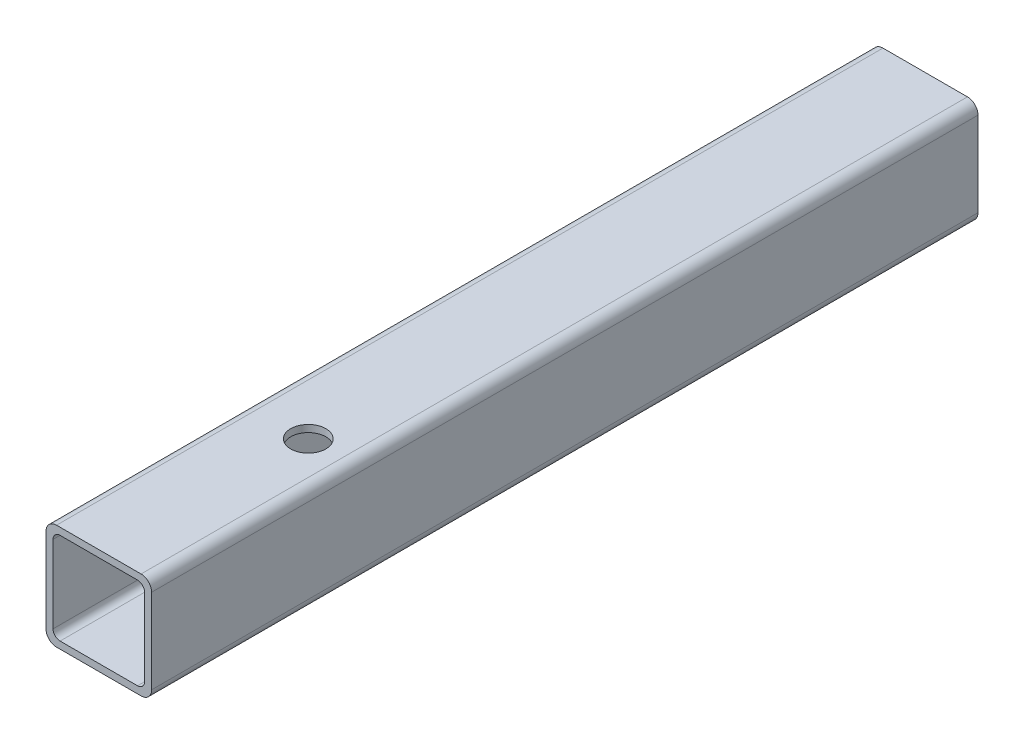
ISO-10303-21;
HEADER;
FILE_DESCRIPTION(('STEP AP214'),'2;1');
FILE_NAME('part.step','',(''),(''),'','','');
FILE_SCHEMA(('AUTOMOTIVE_DESIGN { 1 0 10303 214 1 1 1 1 }'));
ENDSEC;
DATA;
#1=APPLICATION_CONTEXT('core data for automotive mechanical design processes');
#2=APPLICATION_PROTOCOL_DEFINITION('international standard','automotive_design',2000,#1);
#3=PRODUCT_CONTEXT('',#1,'mechanical');
#4=PRODUCT('Part','Part','',(#3));
#5=PRODUCT_RELATED_PRODUCT_CATEGORY('part','',(#4));
#6=PRODUCT_DEFINITION_FORMATION('','',#4);
#7=PRODUCT_DEFINITION_CONTEXT('part definition',#1,'design');
#8=PRODUCT_DEFINITION('design','',#6,#7);
#9=PRODUCT_DEFINITION_SHAPE('','',#8);
#10=(LENGTH_UNIT() NAMED_UNIT(*) SI_UNIT(.MILLI.,.METRE.));
#11=(NAMED_UNIT(*) PLANE_ANGLE_UNIT() SI_UNIT($,.RADIAN.));
#12=(NAMED_UNIT(*) SI_UNIT($,.STERADIAN.) SOLID_ANGLE_UNIT());
#13=UNCERTAINTY_MEASURE_WITH_UNIT(LENGTH_MEASURE(1.E-05),#10,'distance_accuracy_value','');
#14=(GEOMETRIC_REPRESENTATION_CONTEXT(3) GLOBAL_UNCERTAINTY_ASSIGNED_CONTEXT((#13)) GLOBAL_UNIT_ASSIGNED_CONTEXT((#10,
#11,#12)) REPRESENTATION_CONTEXT('',''));
#15=CARTESIAN_POINT('',(0.,0.,0.));
#16=DIRECTION('',(0.,0.,1.));
#17=DIRECTION('',(1.,0.,0.));
#18=AXIS2_PLACEMENT_3D('',#15,#16,#17);
#19=CARTESIAN_POINT('',(-12.,-26.9999999999997,-277.159604319513));
#20=DIRECTION('',(0.,0.,1.));
#21=DIRECTION('',(1.,0.,0.));
#22=AXIS2_PLACEMENT_3D('',#19,#20,#21);
#23=CYLINDRICAL_SURFACE('',#22,3.);
#24=DIRECTION('',(0.,0.,1.));
#25=VECTOR('',#24,1.);
#26=CARTESIAN_POINT('',(-15.,-26.9999999999997,-277.159604319513));
#27=LINE('',#26,#25);
#28=CARTESIAN_POINT('',(-15.,-26.9999999999997,-234.733197448321));
#29=VERTEX_POINT('',#28);
#30=CARTESIAN_POINT('',(-15.,-26.9999999999997,0.));
#31=VERTEX_POINT('',#30);
#32=EDGE_CURVE('E191',#29,#31,#27,.T.);
#33=ORIENTED_EDGE('',*,*,#32,.F.);
#34=CARTESIAN_POINT('',(-12.,-26.9999999999997,-234.733197448321));
#35=DIRECTION('',(0.,0.,-1.));
#36=DIRECTION('',(0.,1.,0.));
#37=AXIS2_PLACEMENT_3D('',#34,#35,#36);
#38=CIRCLE('',#37,3.);
#39=CARTESIAN_POINT('',(-12.,-29.9999999999997,-234.733197448321));
#40=VERTEX_POINT('',#39);
#41=EDGE_CURVE('E184',#29,#40,#38,.F.);
#42=ORIENTED_EDGE('',*,*,#41,.T.);
#43=DIRECTION('',(0.,0.,1.));
#44=VECTOR('',#43,1.);
#45=CARTESIAN_POINT('',(-12.,-29.9999999999997,-277.159604319513));
#46=LINE('',#45,#44);
#47=CARTESIAN_POINT('',(-12.,-29.9999999999997,0.));
#48=VERTEX_POINT('',#47);
#49=EDGE_CURVE('E186',#40,#48,#46,.T.);
#50=ORIENTED_EDGE('',*,*,#49,.T.);
#51=CARTESIAN_POINT('',(-12.,-26.9999999999997,0.));
#52=DIRECTION('',(0.,0.,1.));
#53=DIRECTION('',(1.,0.,0.));
#54=AXIS2_PLACEMENT_3D('',#51,#52,#53);
#55=CIRCLE('',#54,3.);
#56=EDGE_CURVE('E250',#31,#48,#55,.T.);
#57=ORIENTED_EDGE('',*,*,#56,.F.);
#58=EDGE_LOOP('',(#33,#42,#50,#57));
#59=FACE_BOUND('',#58,.T.);
#60=ADVANCED_FACE('F35',(#59),#23,.T.);
#61=CARTESIAN_POINT('',(-15.,-2.99999999999971,-277.159604319513));
#62=DIRECTION('',(-1.,0.,0.));
#63=DIRECTION('',(0.,0.,1.));
#64=AXIS2_PLACEMENT_3D('',#61,#62,#63);
#65=PLANE('',#64);
#66=DIRECTION('',(0.,0.,1.));
#67=VECTOR('',#66,1.);
#68=CARTESIAN_POINT('',(-15.,-2.99999999999971,-277.159604319513));
#69=LINE('',#68,#67);
#70=CARTESIAN_POINT('',(-15.,-2.99999999999971,-234.733197448321));
#71=VERTEX_POINT('',#70);
#72=CARTESIAN_POINT('',(-15.,-2.99999999999971,0.));
#73=VERTEX_POINT('',#72);
#74=EDGE_CURVE('E195',#71,#73,#69,.T.);
#75=ORIENTED_EDGE('',*,*,#74,.F.);
#76=DIRECTION('',(0.,-1.,0.));
#77=VECTOR('',#76,1.);
#78=CARTESIAN_POINT('',(-15.,-2.9999999999997,-234.733197448321));
#79=LINE('',#78,#77);
#80=EDGE_CURVE('E188',#71,#29,#79,.T.);
#81=ORIENTED_EDGE('',*,*,#80,.T.);
#82=ORIENTED_EDGE('',*,*,#32,.T.);
#83=DIRECTION('',(0.,-1.,0.));
#84=VECTOR('',#83,1.);
#85=CARTESIAN_POINT('',(-15.,-2.99999999999971,0.));
#86=LINE('',#85,#84);
#87=EDGE_CURVE('E170',#73,#31,#86,.T.);
#88=ORIENTED_EDGE('',*,*,#87,.F.);
#89=EDGE_LOOP('',(#75,#81,#82,#88));
#90=FACE_BOUND('',#89,.T.);
#91=ADVANCED_FACE('F294',(#90),#65,.T.);
#92=CARTESIAN_POINT('',(-12.,-2.99999999999969,-277.159604319513));
#93=DIRECTION('',(0.,0.,1.));
#94=DIRECTION('',(1.,0.,0.));
#95=AXIS2_PLACEMENT_3D('',#92,#93,#94);
#96=CYLINDRICAL_SURFACE('',#95,3.);
#97=DIRECTION('',(0.,0.,1.));
#98=VECTOR('',#97,1.);
#99=CARTESIAN_POINT('',(-12.,3.13984949151802E-13,-277.159604319513));
#100=LINE('',#99,#98);
#101=CARTESIAN_POINT('',(-12.,3.13984949151802E-13,-234.733197448321));
#102=VERTEX_POINT('',#101);
#103=CARTESIAN_POINT('',(-12.,3.13984949151802E-13,0.));
#104=VERTEX_POINT('',#103);
#105=EDGE_CURVE('E199',#102,#104,#100,.T.);
#106=ORIENTED_EDGE('',*,*,#105,.F.);
#107=CARTESIAN_POINT('',(-12.,-2.99999999999969,-234.733197448321));
#108=DIRECTION('',(0.,0.,-1.));
#109=DIRECTION('',(0.,1.,0.));
#110=AXIS2_PLACEMENT_3D('',#107,#108,#109);
#111=CIRCLE('',#110,3.);
#112=EDGE_CURVE('E192',#102,#71,#111,.F.);
#113=ORIENTED_EDGE('',*,*,#112,.T.);
#114=ORIENTED_EDGE('',*,*,#74,.T.);
#115=CARTESIAN_POINT('',(-12.,-2.99999999999969,0.));
#116=DIRECTION('',(0.,0.,1.));
#117=DIRECTION('',(1.,0.,0.));
#118=AXIS2_PLACEMENT_3D('',#115,#116,#117);
#119=CIRCLE('',#118,3.);
#120=EDGE_CURVE('E327',#104,#73,#119,.T.);
#121=ORIENTED_EDGE('',*,*,#120,.F.);
#122=EDGE_LOOP('',(#106,#113,#114,#121));
#123=FACE_BOUND('',#122,.T.);
#124=ADVANCED_FACE('F300',(#123),#96,.T.);
#125=CARTESIAN_POINT('',(-12.,3.13984949151802E-13,-277.159604319513));
#126=DIRECTION('',(0.,1.,0.));
#127=DIRECTION('',(0.,0.,1.));
#128=AXIS2_PLACEMENT_3D('',#125,#126,#127);
#129=PLANE('',#128);
#130=CARTESIAN_POINT('',(2.50000000000002,0.,-56.9999999999998));
#131=DIRECTION('',(0.,1.,0.));
#132=DIRECTION('',(0.,0.,1.));
#133=AXIS2_PLACEMENT_3D('',#130,#131,#132);
#134=CIRCLE('',#133,5.);
#135=CARTESIAN_POINT('',(2.50000000000002,0.,-51.9999999999998));
#136=VERTEX_POINT('',#135);
#137=EDGE_CURVE('E319',#136,#136,#134,.T.);
#138=ORIENTED_EDGE('',*,*,#137,.F.);
#139=EDGE_LOOP('',(#138));
#140=FACE_BOUND('',#139,.T.);
#141=DIRECTION('',(0.,0.,1.));
#142=VECTOR('',#141,1.);
#143=CARTESIAN_POINT('',(12.,3.13984949151802E-13,-277.159604319513));
#144=LINE('',#143,#142);
#145=CARTESIAN_POINT('',(12.,3.16587034365767E-13,-234.733197448321));
#146=VERTEX_POINT('',#145);
#147=CARTESIAN_POINT('',(12.,3.13984949151802E-13,0.));
#148=VERTEX_POINT('',#147);
#149=EDGE_CURVE('E203',#146,#148,#144,.T.);
#150=ORIENTED_EDGE('',*,*,#149,.F.);
#151=DIRECTION('',(-1.,0.,0.));
#152=VECTOR('',#151,1.);
#153=CARTESIAN_POINT('',(-12.,3.13984949151802E-13,-234.733197448321));
#154=LINE('',#153,#152);
#155=EDGE_CURVE('E196',#146,#102,#154,.T.);
#156=ORIENTED_EDGE('',*,*,#155,.T.);
#157=ORIENTED_EDGE('',*,*,#105,.T.);
#158=DIRECTION('',(-1.,0.,0.));
#159=VECTOR('',#158,1.);
#160=CARTESIAN_POINT('',(-12.,3.13984949151802E-13,0.));
#161=LINE('',#160,#159);
#162=EDGE_CURVE('E330',#148,#104,#161,.T.);
#163=ORIENTED_EDGE('',*,*,#162,.F.);
#164=EDGE_LOOP('',(#150,#156,#157,#163));
#165=FACE_BOUND('',#164,.T.);
#166=ADVANCED_FACE('F357',(#140,#165),#129,.T.);
#167=CARTESIAN_POINT('',(12.,-2.99999999999969,-277.159604319513));
#168=DIRECTION('',(0.,0.,1.));
#169=DIRECTION('',(1.,0.,0.));
#170=AXIS2_PLACEMENT_3D('',#167,#168,#169);
#171=CYLINDRICAL_SURFACE('',#170,3.);
#172=DIRECTION('',(0.,0.,1.));
#173=VECTOR('',#172,1.);
#174=CARTESIAN_POINT('',(15.,-2.99999999999968,-277.159604319513));
#175=LINE('',#174,#173);
#176=CARTESIAN_POINT('',(15.,-2.99999999999968,-234.733197448321));
#177=VERTEX_POINT('',#176);
#178=CARTESIAN_POINT('',(15.,-2.99999999999968,0.));
#179=VERTEX_POINT('',#178);
#180=EDGE_CURVE('E207',#177,#179,#175,.T.);
#181=ORIENTED_EDGE('',*,*,#180,.F.);
#182=CARTESIAN_POINT('',(12.,-2.99999999999969,-234.733197448321));
#183=DIRECTION('',(0.,0.,-1.));
#184=DIRECTION('',(0.,1.,0.));
#185=AXIS2_PLACEMENT_3D('',#182,#183,#184);
#186=CIRCLE('',#185,3.);
#187=EDGE_CURVE('E200',#177,#146,#186,.F.);
#188=ORIENTED_EDGE('',*,*,#187,.T.);
#189=ORIENTED_EDGE('',*,*,#149,.T.);
#190=CARTESIAN_POINT('',(12.,-2.99999999999969,0.));
#191=DIRECTION('',(0.,0.,1.));
#192=DIRECTION('',(-1.,0.,0.));
#193=AXIS2_PLACEMENT_3D('',#190,#191,#192);
#194=CIRCLE('',#193,3.);
#195=EDGE_CURVE('E333',#179,#148,#194,.T.);
#196=ORIENTED_EDGE('',*,*,#195,.F.);
#197=EDGE_LOOP('',(#181,#188,#189,#196));
#198=FACE_BOUND('',#197,.T.);
#199=ADVANCED_FACE('F351',(#198),#171,.T.);
#200=CARTESIAN_POINT('',(15.,-2.99999999999969,-277.159604319513));
#201=DIRECTION('',(1.,0.,0.));
#202=DIRECTION('',(0.,1.,0.));
#203=AXIS2_PLACEMENT_3D('',#200,#201,#202);
#204=PLANE('',#203);
#205=DIRECTION('',(0.,0.,1.));
#206=VECTOR('',#205,1.);
#207=CARTESIAN_POINT('',(15.,-26.9999999999997,-277.159604319513));
#208=LINE('',#207,#206);
#209=CARTESIAN_POINT('',(15.,-26.9999999999997,-234.733197448321));
#210=VERTEX_POINT('',#209);
#211=CARTESIAN_POINT('',(15.,-26.9999999999997,0.));
#212=VERTEX_POINT('',#211);
#213=EDGE_CURVE('E210',#210,#212,#208,.T.);
#214=ORIENTED_EDGE('',*,*,#213,.F.);
#215=DIRECTION('',(0.,1.,0.));
#216=VECTOR('',#215,1.);
#217=CARTESIAN_POINT('',(15.,-2.99999999999968,-234.733197448321));
#218=LINE('',#217,#216);
#219=EDGE_CURVE('E204',#210,#177,#218,.T.);
#220=ORIENTED_EDGE('',*,*,#219,.T.);
#221=ORIENTED_EDGE('',*,*,#180,.T.);
#222=DIRECTION('',(0.,1.,0.));
#223=VECTOR('',#222,1.);
#224=CARTESIAN_POINT('',(15.,-2.99999999999969,0.));
#225=LINE('',#224,#223);
#226=EDGE_CURVE('E336',#212,#179,#225,.T.);
#227=ORIENTED_EDGE('',*,*,#226,.F.);
#228=EDGE_LOOP('',(#214,#220,#221,#227));
#229=FACE_BOUND('',#228,.T.);
#230=ADVANCED_FACE('F347',(#229),#204,.T.);
#231=CARTESIAN_POINT('',(12.,-26.9999999999997,-277.159604319513));
#232=DIRECTION('',(0.,0.,1.));
#233=DIRECTION('',(1.,0.,0.));
#234=AXIS2_PLACEMENT_3D('',#231,#232,#233);
#235=CYLINDRICAL_SURFACE('',#234,3.);
#236=DIRECTION('',(0.,0.,1.));
#237=VECTOR('',#236,1.);
#238=CARTESIAN_POINT('',(12.,-29.9999999999997,-277.159604319513));
#239=LINE('',#238,#237);
#240=CARTESIAN_POINT('',(12.,-29.9999999999997,-234.733197448321));
#241=VERTEX_POINT('',#240);
#242=CARTESIAN_POINT('',(12.,-29.9999999999997,0.));
#243=VERTEX_POINT('',#242);
#244=EDGE_CURVE('E218',#241,#243,#239,.T.);
#245=ORIENTED_EDGE('',*,*,#244,.F.);
#246=CARTESIAN_POINT('',(12.,-26.9999999999997,-234.733197448321));
#247=DIRECTION('',(0.,0.,-1.));
#248=DIRECTION('',(0.,1.,0.));
#249=AXIS2_PLACEMENT_3D('',#246,#247,#248);
#250=CIRCLE('',#249,3.);
#251=EDGE_CURVE('E208',#241,#210,#250,.F.);
#252=ORIENTED_EDGE('',*,*,#251,.T.);
#253=ORIENTED_EDGE('',*,*,#213,.T.);
#254=CARTESIAN_POINT('',(12.,-26.9999999999997,0.));
#255=DIRECTION('',(0.,0.,1.));
#256=DIRECTION('',(1.,0.,0.));
#257=AXIS2_PLACEMENT_3D('',#254,#255,#256);
#258=CIRCLE('',#257,3.);
#259=EDGE_CURVE('E259',#243,#212,#258,.T.);
#260=ORIENTED_EDGE('',*,*,#259,.F.);
#261=EDGE_LOOP('',(#245,#252,#253,#260));
#262=FACE_BOUND('',#261,.T.);
#263=ADVANCED_FACE('F344',(#262),#235,.T.);
#264=CARTESIAN_POINT('',(-12.,-29.9999999999997,-277.159604319513));
#265=DIRECTION('',(0.,-1.,0.));
#266=DIRECTION('',(0.,0.,-1.));
#267=AXIS2_PLACEMENT_3D('',#264,#265,#266);
#268=PLANE('',#267);
#269=CARTESIAN_POINT('',(2.50000000000002,-29.9999999999997,-56.9999999999998));
#270=DIRECTION('',(0.,1.,0.));
#271=DIRECTION('',(0.,0.,1.));
#272=AXIS2_PLACEMENT_3D('',#269,#270,#271);
#273=CIRCLE('',#272,5.);
#274=CARTESIAN_POINT('',(2.50000000000002,-29.9999999999997,-51.9999999999998));
#275=VERTEX_POINT('',#274);
#276=EDGE_CURVE('E315',#275,#275,#273,.T.);
#277=ORIENTED_EDGE('',*,*,#276,.T.);
#278=EDGE_LOOP('',(#277));
#279=FACE_BOUND('',#278,.T.);
#280=ORIENTED_EDGE('',*,*,#49,.F.);
#281=DIRECTION('',(1.,0.,0.));
#282=VECTOR('',#281,1.);
#283=CARTESIAN_POINT('',(-12.,-29.9999999999997,-234.733197448321));
#284=LINE('',#283,#282);
#285=EDGE_CURVE('E53',#40,#241,#284,.T.);
#286=ORIENTED_EDGE('',*,*,#285,.T.);
#287=ORIENTED_EDGE('',*,*,#244,.T.);
#288=DIRECTION('',(1.,0.,0.));
#289=VECTOR('',#288,1.);
#290=CARTESIAN_POINT('',(-12.,-29.9999999999997,0.));
#291=LINE('',#290,#289);
#292=EDGE_CURVE('E253',#48,#243,#291,.T.);
#293=ORIENTED_EDGE('',*,*,#292,.F.);
#294=EDGE_LOOP('',(#280,#286,#287,#293));
#295=FACE_BOUND('',#294,.T.);
#296=ADVANCED_FACE('F363',(#279,#295),#268,.T.);
#297=CARTESIAN_POINT('',(-11.,-25.9999999999997,-277.159604319513));
#298=DIRECTION('',(0.,0.,1.));
#299=DIRECTION('',(1.,0.,0.));
#300=AXIS2_PLACEMENT_3D('',#297,#298,#299);
#301=CYLINDRICAL_SURFACE('',#300,2.);
#302=CARTESIAN_POINT('',(-11.,-25.9999999999997,-234.733197448321));
#303=DIRECTION('',(0.,0.,-1.));
#304=DIRECTION('',(0.,1.,0.));
#305=AXIS2_PLACEMENT_3D('',#302,#303,#304);
#306=CIRCLE('',#305,2.);
#307=CARTESIAN_POINT('',(-13.,-25.9999999999997,-234.733197448321));
#308=VERTEX_POINT('',#307);
#309=CARTESIAN_POINT('',(-11.,-27.9999999999997,-234.733197448321));
#310=VERTEX_POINT('',#309);
#311=EDGE_CURVE('E148',#308,#310,#306,.F.);
#312=ORIENTED_EDGE('',*,*,#311,.F.);
#313=DIRECTION('',(0.,0.,1.));
#314=VECTOR('',#313,1.);
#315=CARTESIAN_POINT('',(-13.,-25.9999999999997,-277.159604319513));
#316=LINE('',#315,#314);
#317=CARTESIAN_POINT('',(-13.,-25.9999999999997,0.));
#318=VERTEX_POINT('',#317);
#319=EDGE_CURVE('E220',#308,#318,#316,.T.);
#320=ORIENTED_EDGE('',*,*,#319,.T.);
#321=CARTESIAN_POINT('',(-11.,-25.9999999999997,0.));
#322=DIRECTION('',(0.,0.,1.));
#323=DIRECTION('',(1.,0.,0.));
#324=AXIS2_PLACEMENT_3D('',#321,#322,#323);
#325=CIRCLE('',#324,2.);
#326=CARTESIAN_POINT('',(-11.,-27.9999999999997,0.));
#327=VERTEX_POINT('',#326);
#328=EDGE_CURVE('E151',#318,#327,#325,.T.);
#329=ORIENTED_EDGE('',*,*,#328,.T.);
#330=DIRECTION('',(0.,0.,1.));
#331=VECTOR('',#330,1.);
#332=CARTESIAN_POINT('',(-11.,-27.9999999999997,-277.159604319513));
#333=LINE('',#332,#331);
#334=EDGE_CURVE('E144',#310,#327,#333,.T.);
#335=ORIENTED_EDGE('',*,*,#334,.F.);
#336=EDGE_LOOP('',(#312,#320,#329,#335));
#337=FACE_BOUND('',#336,.T.);
#338=ADVANCED_FACE('F146',(#337),#301,.F.);
#339=CARTESIAN_POINT('',(-13.,-3.9999999999997,-277.159604319513));
#340=DIRECTION('',(-1.,0.,0.));
#341=DIRECTION('',(0.,0.,1.));
#342=AXIS2_PLACEMENT_3D('',#339,#340,#341);
#343=PLANE('',#342);
#344=DIRECTION('',(0.,-1.,0.));
#345=VECTOR('',#344,1.);
#346=CARTESIAN_POINT('',(-13.,-3.99999999999969,-234.733197448321));
#347=LINE('',#346,#345);
#348=CARTESIAN_POINT('',(-13.,-3.9999999999997,-234.733197448321));
#349=VERTEX_POINT('',#348);
#350=EDGE_CURVE('E168',#349,#308,#347,.T.);
#351=ORIENTED_EDGE('',*,*,#350,.F.);
#352=DIRECTION('',(0.,0.,1.));
#353=VECTOR('',#352,1.);
#354=CARTESIAN_POINT('',(-13.,-3.9999999999997,-277.159604319513));
#355=LINE('',#354,#353);
#356=CARTESIAN_POINT('',(-13.,-3.9999999999997,0.));
#357=VERTEX_POINT('',#356);
#358=EDGE_CURVE('E223',#349,#357,#355,.T.);
#359=ORIENTED_EDGE('',*,*,#358,.T.);
#360=DIRECTION('',(0.,-1.,0.));
#361=VECTOR('',#360,1.);
#362=CARTESIAN_POINT('',(-13.,-3.9999999999997,0.));
#363=LINE('',#362,#361);
#364=EDGE_CURVE('E225',#357,#318,#363,.T.);
#365=ORIENTED_EDGE('',*,*,#364,.T.);
#366=ORIENTED_EDGE('',*,*,#319,.F.);
#367=EDGE_LOOP('',(#351,#359,#365,#366));
#368=FACE_BOUND('',#367,.T.);
#369=ADVANCED_FACE('F370',(#368),#343,.F.);
#370=CARTESIAN_POINT('',(-11.,-3.99999999999969,-277.159604319513));
#371=DIRECTION('',(0.,0.,1.));
#372=DIRECTION('',(1.,0.,0.));
#373=AXIS2_PLACEMENT_3D('',#370,#371,#372);
#374=CYLINDRICAL_SURFACE('',#373,2.);
#375=CARTESIAN_POINT('',(-11.,-3.99999999999969,-234.733197448321));
#376=DIRECTION('',(0.,0.,-1.));
#377=DIRECTION('',(0.,1.,0.));
#378=AXIS2_PLACEMENT_3D('',#375,#376,#377);
#379=CIRCLE('',#378,2.);
#380=CARTESIAN_POINT('',(-11.,-1.99999999999969,-234.733197448321));
#381=VERTEX_POINT('',#380);
#382=EDGE_CURVE('E11',#381,#349,#379,.F.);
#383=ORIENTED_EDGE('',*,*,#382,.F.);
#384=DIRECTION('',(0.,0.,1.));
#385=VECTOR('',#384,1.);
#386=CARTESIAN_POINT('',(-11.,-1.99999999999969,-277.159604319513));
#387=LINE('',#386,#385);
#388=CARTESIAN_POINT('',(-11.,-1.99999999999969,0.));
#389=VERTEX_POINT('',#388);
#390=EDGE_CURVE('E226',#381,#389,#387,.T.);
#391=ORIENTED_EDGE('',*,*,#390,.T.);
#392=CARTESIAN_POINT('',(-11.,-3.99999999999969,0.));
#393=DIRECTION('',(0.,0.,1.));
#394=DIRECTION('',(1.,0.,0.));
#395=AXIS2_PLACEMENT_3D('',#392,#393,#394);
#396=CIRCLE('',#395,2.);
#397=EDGE_CURVE('E228',#389,#357,#396,.T.);
#398=ORIENTED_EDGE('',*,*,#397,.T.);
#399=ORIENTED_EDGE('',*,*,#358,.F.);
#400=EDGE_LOOP('',(#383,#391,#398,#399));
#401=FACE_BOUND('',#400,.T.);
#402=ADVANCED_FACE('F279',(#401),#374,.F.);
#403=CARTESIAN_POINT('',(-11.,-1.99999999999969,-277.159604319513));
#404=DIRECTION('',(0.,1.,0.));
#405=DIRECTION('',(0.,0.,1.));
#406=AXIS2_PLACEMENT_3D('',#403,#404,#405);
#407=PLANE('',#406);
#408=CARTESIAN_POINT('',(2.50000000000002,-1.99999999999969,-56.9999999999998));
#409=DIRECTION('',(0.,1.,0.));
#410=DIRECTION('',(0.,0.,1.));
#411=AXIS2_PLACEMENT_3D('',#408,#409,#410);
#412=CIRCLE('',#411,5.);
#413=CARTESIAN_POINT('',(2.50000000000002,-1.99999999999969,-51.9999999999998));
#414=VERTEX_POINT('',#413);
#415=EDGE_CURVE('E187',#414,#414,#412,.T.);
#416=ORIENTED_EDGE('',*,*,#415,.T.);
#417=EDGE_LOOP('',(#416));
#418=FACE_BOUND('',#417,.T.);
#419=DIRECTION('',(-1.,0.,0.));
#420=VECTOR('',#419,1.);
#421=CARTESIAN_POINT('',(-11.,-1.99999999999969,-234.733197448321));
#422=LINE('',#421,#420);
#423=CARTESIAN_POINT('',(11.,-1.99999999999969,-234.733197448321));
#424=VERTEX_POINT('',#423);
#425=EDGE_CURVE('E45',#424,#381,#422,.T.);
#426=ORIENTED_EDGE('',*,*,#425,.F.);
#427=DIRECTION('',(0.,0.,1.));
#428=VECTOR('',#427,1.);
#429=CARTESIAN_POINT('',(11.,-1.99999999999969,-277.159604319513));
#430=LINE('',#429,#428);
#431=CARTESIAN_POINT('',(11.,-1.99999999999969,0.));
#432=VERTEX_POINT('',#431);
#433=EDGE_CURVE('E229',#424,#432,#430,.T.);
#434=ORIENTED_EDGE('',*,*,#433,.T.);
#435=DIRECTION('',(-1.,0.,0.));
#436=VECTOR('',#435,1.);
#437=CARTESIAN_POINT('',(-11.,-1.99999999999969,0.));
#438=LINE('',#437,#436);
#439=EDGE_CURVE('E231',#432,#389,#438,.T.);
#440=ORIENTED_EDGE('',*,*,#439,.T.);
#441=ORIENTED_EDGE('',*,*,#390,.F.);
#442=EDGE_LOOP('',(#426,#434,#440,#441));
#443=FACE_BOUND('',#442,.T.);
#444=ADVANCED_FACE('F271',(#418,#443),#407,.F.);
#445=CARTESIAN_POINT('',(11.,-3.99999999999969,-277.159604319513));
#446=DIRECTION('',(0.,0.,1.));
#447=DIRECTION('',(1.,0.,0.));
#448=AXIS2_PLACEMENT_3D('',#445,#446,#447);
#449=CYLINDRICAL_SURFACE('',#448,2.);
#450=CARTESIAN_POINT('',(11.,-3.99999999999969,-234.733197448321));
#451=DIRECTION('',(0.,0.,-1.));
#452=DIRECTION('',(0.,1.,0.));
#453=AXIS2_PLACEMENT_3D('',#450,#451,#452);
#454=CIRCLE('',#453,2.);
#455=CARTESIAN_POINT('',(13.,-3.9999999999997,-234.733197448321));
#456=VERTEX_POINT('',#455);
#457=EDGE_CURVE('E177',#456,#424,#454,.F.);
#458=ORIENTED_EDGE('',*,*,#457,.F.);
#459=DIRECTION('',(0.,0.,1.));
#460=VECTOR('',#459,1.);
#461=CARTESIAN_POINT('',(13.,-3.9999999999997,-277.159604319513));
#462=LINE('',#461,#460);
#463=CARTESIAN_POINT('',(13.,-3.9999999999997,0.));
#464=VERTEX_POINT('',#463);
#465=EDGE_CURVE('E232',#456,#464,#462,.T.);
#466=ORIENTED_EDGE('',*,*,#465,.T.);
#467=CARTESIAN_POINT('',(11.,-3.99999999999969,0.));
#468=DIRECTION('',(0.,0.,1.));
#469=DIRECTION('',(-1.,0.,0.));
#470=AXIS2_PLACEMENT_3D('',#467,#468,#469);
#471=CIRCLE('',#470,2.);
#472=EDGE_CURVE('E234',#464,#432,#471,.T.);
#473=ORIENTED_EDGE('',*,*,#472,.T.);
#474=ORIENTED_EDGE('',*,*,#433,.F.);
#475=EDGE_LOOP('',(#458,#466,#473,#474));
#476=FACE_BOUND('',#475,.T.);
#477=ADVANCED_FACE('F281',(#476),#449,.F.);
#478=CARTESIAN_POINT('',(13.,-3.9999999999997,-277.159604319513));
#479=DIRECTION('',(1.,0.,0.));
#480=DIRECTION('',(0.,0.,-1.));
#481=AXIS2_PLACEMENT_3D('',#478,#479,#480);
#482=PLANE('',#481);
#483=DIRECTION('',(0.,1.,0.));
#484=VECTOR('',#483,1.);
#485=CARTESIAN_POINT('',(13.,-3.99999999999969,-234.733197448321));
#486=LINE('',#485,#484);
#487=CARTESIAN_POINT('',(13.,-25.9999999999997,-234.733197448321));
#488=VERTEX_POINT('',#487);
#489=EDGE_CURVE('E180',#488,#456,#486,.T.);
#490=ORIENTED_EDGE('',*,*,#489,.F.);
#491=DIRECTION('',(0.,0.,1.));
#492=VECTOR('',#491,1.);
#493=CARTESIAN_POINT('',(13.,-25.9999999999997,-277.159604319513));
#494=LINE('',#493,#492);
#495=CARTESIAN_POINT('',(13.,-25.9999999999997,0.));
#496=VERTEX_POINT('',#495);
#497=EDGE_CURVE('E235',#488,#496,#494,.T.);
#498=ORIENTED_EDGE('',*,*,#497,.T.);
#499=DIRECTION('',(0.,1.,0.));
#500=VECTOR('',#499,1.);
#501=CARTESIAN_POINT('',(13.,-3.9999999999997,0.));
#502=LINE('',#501,#500);
#503=EDGE_CURVE('E237',#496,#464,#502,.T.);
#504=ORIENTED_EDGE('',*,*,#503,.T.);
#505=ORIENTED_EDGE('',*,*,#465,.F.);
#506=EDGE_LOOP('',(#490,#498,#504,#505));
#507=FACE_BOUND('',#506,.T.);
#508=ADVANCED_FACE('F284',(#507),#482,.F.);
#509=CARTESIAN_POINT('',(11.,-25.9999999999997,-277.159604319513));
#510=DIRECTION('',(0.,0.,1.));
#511=DIRECTION('',(1.,0.,0.));
#512=AXIS2_PLACEMENT_3D('',#509,#510,#511);
#513=CYLINDRICAL_SURFACE('',#512,2.);
#514=CARTESIAN_POINT('',(11.,-25.9999999999997,-234.733197448321));
#515=DIRECTION('',(0.,0.,-1.));
#516=DIRECTION('',(0.,1.,0.));
#517=AXIS2_PLACEMENT_3D('',#514,#515,#516);
#518=CIRCLE('',#517,2.);
#519=CARTESIAN_POINT('',(11.,-27.9999999999997,-234.733197448321));
#520=VERTEX_POINT('',#519);
#521=EDGE_CURVE('E165',#520,#488,#518,.F.);
#522=ORIENTED_EDGE('',*,*,#521,.F.);
#523=DIRECTION('',(0.,0.,1.));
#524=VECTOR('',#523,1.);
#525=CARTESIAN_POINT('',(11.,-27.9999999999997,-277.159604319513));
#526=LINE('',#525,#524);
#527=CARTESIAN_POINT('',(11.,-27.9999999999997,0.));
#528=VERTEX_POINT('',#527);
#529=EDGE_CURVE('E161',#520,#528,#526,.T.);
#530=ORIENTED_EDGE('',*,*,#529,.T.);
#531=CARTESIAN_POINT('',(11.,-25.9999999999997,0.));
#532=DIRECTION('',(0.,0.,1.));
#533=DIRECTION('',(1.,0.,0.));
#534=AXIS2_PLACEMENT_3D('',#531,#532,#533);
#535=CIRCLE('',#534,2.);
#536=EDGE_CURVE('E156',#528,#496,#535,.T.);
#537=ORIENTED_EDGE('',*,*,#536,.T.);
#538=ORIENTED_EDGE('',*,*,#497,.F.);
#539=EDGE_LOOP('',(#522,#530,#537,#538));
#540=FACE_BOUND('',#539,.T.);
#541=ADVANCED_FACE('F283',(#540),#513,.F.);
#542=CARTESIAN_POINT('',(-11.,-27.9999999999997,-277.159604319513));
#543=DIRECTION('',(0.,-1.,0.));
#544=DIRECTION('',(0.,0.,-1.));
#545=AXIS2_PLACEMENT_3D('',#542,#543,#544);
#546=PLANE('',#545);
#547=CARTESIAN_POINT('',(2.50000000000002,-27.9999999999997,-56.9999999999998));
#548=DIRECTION('',(0.,-1.,0.));
#549=DIRECTION('',(0.,0.,-1.));
#550=AXIS2_PLACEMENT_3D('',#547,#548,#549);
#551=CIRCLE('',#550,5.);
#552=CARTESIAN_POINT('',(2.50000000000002,-27.9999999999997,-61.9999999999998));
#553=VERTEX_POINT('',#552);
#554=EDGE_CURVE('E39',#553,#553,#551,.T.);
#555=ORIENTED_EDGE('',*,*,#554,.T.);
#556=EDGE_LOOP('',(#555));
#557=FACE_BOUND('',#556,.T.);
#558=DIRECTION('',(1.,0.,0.));
#559=VECTOR('',#558,1.);
#560=CARTESIAN_POINT('',(-11.,-27.9999999999997,-234.733197448321));
#561=LINE('',#560,#559);
#562=EDGE_CURVE('E159',#310,#520,#561,.T.);
#563=ORIENTED_EDGE('',*,*,#562,.F.);
#564=ORIENTED_EDGE('',*,*,#334,.T.);
#565=DIRECTION('',(1.,0.,0.));
#566=VECTOR('',#565,1.);
#567=CARTESIAN_POINT('',(-11.,-27.9999999999997,0.));
#568=LINE('',#567,#566);
#569=EDGE_CURVE('E155',#327,#528,#568,.T.);
#570=ORIENTED_EDGE('',*,*,#569,.T.);
#571=ORIENTED_EDGE('',*,*,#529,.F.);
#572=EDGE_LOOP('',(#563,#564,#570,#571));
#573=FACE_BOUND('',#572,.T.);
#574=ADVANCED_FACE('F160',(#557,#573),#546,.F.);
#575=CARTESIAN_POINT('',(-12.,-26.9999999999997,0.));
#576=DIRECTION('',(0.,0.,1.));
#577=DIRECTION('',(1.,0.,0.));
#578=AXIS2_PLACEMENT_3D('',#575,#576,#577);
#579=PLANE('',#578);
#580=ORIENTED_EDGE('',*,*,#328,.F.);
#581=ORIENTED_EDGE('',*,*,#364,.F.);
#582=ORIENTED_EDGE('',*,*,#397,.F.);
#583=ORIENTED_EDGE('',*,*,#439,.F.);
#584=ORIENTED_EDGE('',*,*,#472,.F.);
#585=ORIENTED_EDGE('',*,*,#503,.F.);
#586=ORIENTED_EDGE('',*,*,#536,.F.);
#587=ORIENTED_EDGE('',*,*,#569,.F.);
#588=EDGE_LOOP('',(#580,#581,#582,#583,#584,#585,#586,#587));
#589=FACE_BOUND('',#588,.T.);
#590=ORIENTED_EDGE('',*,*,#56,.T.);
#591=ORIENTED_EDGE('',*,*,#292,.T.);
#592=ORIENTED_EDGE('',*,*,#259,.T.);
#593=ORIENTED_EDGE('',*,*,#226,.T.);
#594=ORIENTED_EDGE('',*,*,#195,.T.);
#595=ORIENTED_EDGE('',*,*,#162,.T.);
#596=ORIENTED_EDGE('',*,*,#120,.T.);
#597=ORIENTED_EDGE('',*,*,#87,.T.);
#598=EDGE_LOOP('',(#590,#591,#592,#593,#594,#595,#596,#597));
#599=FACE_BOUND('',#598,.T.);
#600=ADVANCED_FACE('F276',(#589,#599),#579,.T.);
#601=CARTESIAN_POINT('',(472.426406871195,-2.99999999999935,-234.733197448321));
#602=DIRECTION('',(0.,0.,-1.));
#603=DIRECTION('',(-1.,0.,0.));
#604=AXIS2_PLACEMENT_3D('',#601,#602,#603);
#605=PLANE('',#604);
#606=ORIENTED_EDGE('',*,*,#41,.F.);
#607=ORIENTED_EDGE('',*,*,#80,.F.);
#608=ORIENTED_EDGE('',*,*,#112,.F.);
#609=ORIENTED_EDGE('',*,*,#155,.F.);
#610=ORIENTED_EDGE('',*,*,#187,.F.);
#611=ORIENTED_EDGE('',*,*,#219,.F.);
#612=ORIENTED_EDGE('',*,*,#251,.F.);
#613=ORIENTED_EDGE('',*,*,#285,.F.);
#614=EDGE_LOOP('',(#606,#607,#608,#609,#610,#611,#612,#613));
#615=FACE_BOUND('',#614,.T.);
#616=ORIENTED_EDGE('',*,*,#350,.T.);
#617=ORIENTED_EDGE('',*,*,#311,.T.);
#618=ORIENTED_EDGE('',*,*,#562,.T.);
#619=ORIENTED_EDGE('',*,*,#521,.T.);
#620=ORIENTED_EDGE('',*,*,#489,.T.);
#621=ORIENTED_EDGE('',*,*,#457,.T.);
#622=ORIENTED_EDGE('',*,*,#425,.T.);
#623=ORIENTED_EDGE('',*,*,#382,.T.);
#624=EDGE_LOOP('',(#616,#617,#618,#619,#620,#621,#622,#623));
#625=FACE_BOUND('',#624,.T.);
#626=ADVANCED_FACE('F37',(#615,#625),#605,.T.);
#627=CARTESIAN_POINT('',(2.50000000000002,-29.9999999999997,-56.9999999999998));
#628=DIRECTION('',(0.,1.,0.));
#629=DIRECTION('',(0.,0.,1.));
#630=AXIS2_PLACEMENT_3D('',#627,#628,#629);
#631=CYLINDRICAL_SURFACE('',#630,5.);
#632=ORIENTED_EDGE('',*,*,#276,.F.);
#633=EDGE_LOOP('',(#632));
#634=FACE_BOUND('',#633,.T.);
#635=ORIENTED_EDGE('',*,*,#554,.F.);
#636=EDGE_LOOP('',(#635));
#637=FACE_BOUND('',#636,.T.);
#638=ADVANCED_FACE('F458',(#634,#637),#631,.F.);
#639=ORIENTED_EDGE('',*,*,#137,.T.);
#640=EDGE_LOOP('',(#639));
#641=FACE_BOUND('',#640,.T.);
#642=ORIENTED_EDGE('',*,*,#415,.F.);
#643=EDGE_LOOP('',(#642));
#644=FACE_BOUND('',#643,.T.);
#645=ADVANCED_FACE('F467',(#641,#644),#631,.F.);
#646=CLOSED_SHELL('',(#60,#91,#124,#166,#199,#230,#263,#296,#338,#369,#402,#444,#477,#508,#541,
#574,#600,#626,#638,#645));
#647=MANIFOLD_SOLID_BREP('B2',#646);
#648=ADVANCED_BREP_SHAPE_REPRESENTATION('',(#18,#647),#14);
#649=SHAPE_DEFINITION_REPRESENTATION(#9,#648);
ENDSEC;
END-ISO-10303-21;
